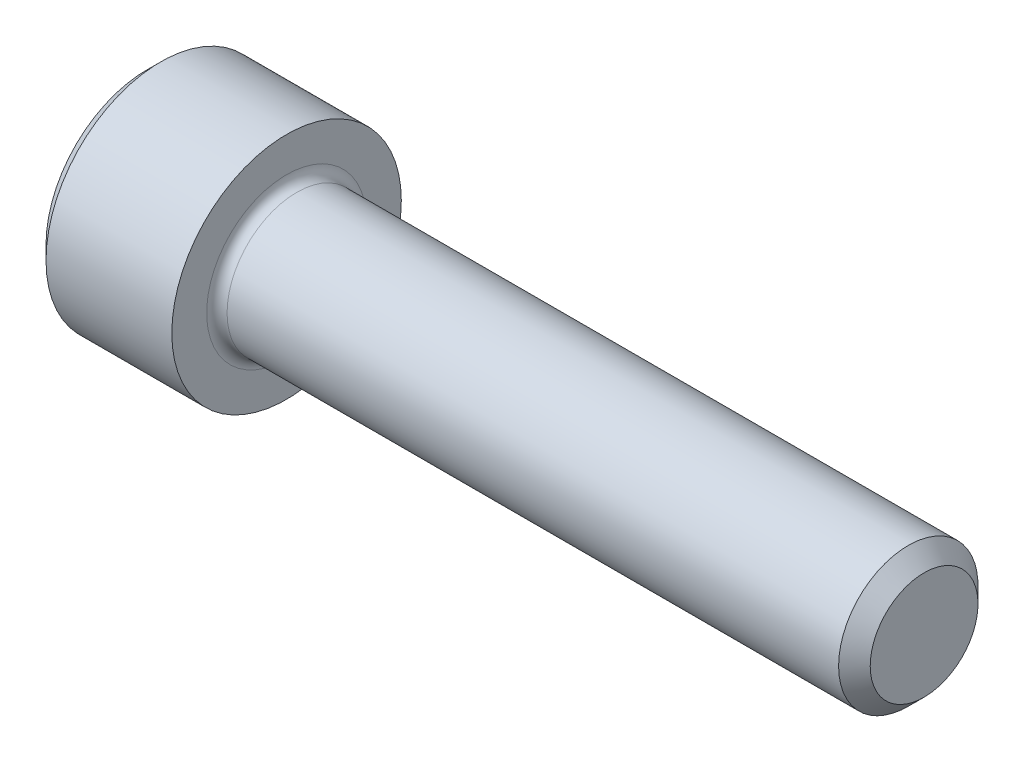
ISO-10303-21;
HEADER;
FILE_DESCRIPTION(('STEP AP214'),'2;1');
FILE_NAME('part.step','',(''),(''),'','','');
FILE_SCHEMA(('AUTOMOTIVE_DESIGN { 1 0 10303 214 1 1 1 1 }'));
ENDSEC;
DATA;
#1=APPLICATION_CONTEXT('core data for automotive mechanical design processes');
#2=APPLICATION_PROTOCOL_DEFINITION('international standard','automotive_design',2000,#1);
#3=PRODUCT_CONTEXT('',#1,'mechanical');
#4=PRODUCT('Part','Part','',(#3));
#5=PRODUCT_RELATED_PRODUCT_CATEGORY('part','',(#4));
#6=PRODUCT_DEFINITION_FORMATION('','',#4);
#7=PRODUCT_DEFINITION_CONTEXT('part definition',#1,'design');
#8=PRODUCT_DEFINITION('design','',#6,#7);
#9=PRODUCT_DEFINITION_SHAPE('','',#8);
#10=(LENGTH_UNIT() NAMED_UNIT(*) SI_UNIT(.MILLI.,.METRE.));
#11=(NAMED_UNIT(*) PLANE_ANGLE_UNIT() SI_UNIT($,.RADIAN.));
#12=(NAMED_UNIT(*) SI_UNIT($,.STERADIAN.) SOLID_ANGLE_UNIT());
#13=UNCERTAINTY_MEASURE_WITH_UNIT(LENGTH_MEASURE(1.E-05),#10,'distance_accuracy_value','');
#14=(GEOMETRIC_REPRESENTATION_CONTEXT(3) GLOBAL_UNCERTAINTY_ASSIGNED_CONTEXT((#13)) GLOBAL_UNIT_ASSIGNED_CONTEXT((#10,
#11,#12)) REPRESENTATION_CONTEXT('',''));
#15=CARTESIAN_POINT('',(0.,0.,0.));
#16=DIRECTION('',(0.,0.,1.));
#17=DIRECTION('',(1.,0.,0.));
#18=AXIS2_PLACEMENT_3D('',#15,#16,#17);
#19=CARTESIAN_POINT('',(0.,0.,0.));
#20=DIRECTION('',(-1.,0.,0.));
#21=DIRECTION('',(0.,0.,1.));
#22=AXIS2_PLACEMENT_3D('',#19,#20,#21);
#23=PLANE('',#22);
#24=CARTESIAN_POINT('',(0.,0.,0.));
#25=DIRECTION('',(-1.,0.,0.));
#26=DIRECTION('',(0.,0.,1.));
#27=AXIS2_PLACEMENT_3D('',#24,#25,#26);
#28=CIRCLE('',#27,3.02260000000001);
#29=CARTESIAN_POINT('',(0.,0.,3.02260000000001));
#30=VERTEX_POINT('',#29);
#31=EDGE_CURVE('E134',#30,#30,#28,.T.);
#32=ORIENTED_EDGE('',*,*,#31,.T.);
#33=EDGE_LOOP('',(#32));
#34=FACE_BOUND('',#33,.T.);
#35=DIRECTION('',(0.,-0.500000000000001,-0.866025403784438));
#36=VECTOR('',#35,1.);
#37=CARTESIAN_POINT('',(0.,2.05305755723831,0.));
#38=LINE('',#37,#36);
#39=CARTESIAN_POINT('',(0.,2.05305755723831,0.));
#40=VERTEX_POINT('',#39);
#41=CARTESIAN_POINT('',(0.,1.02652877861916,-1.778));
#42=VERTEX_POINT('',#41);
#43=EDGE_CURVE('E125',#40,#42,#38,.T.);
#44=ORIENTED_EDGE('',*,*,#43,.F.);
#45=DIRECTION('',(0.,-0.499999999999998,0.86602540378444));
#46=VECTOR('',#45,1.);
#47=CARTESIAN_POINT('',(0.,2.05305755723831,0.));
#48=LINE('',#47,#46);
#49=CARTESIAN_POINT('',(0.,1.02652877861916,1.778));
#50=VERTEX_POINT('',#49);
#51=EDGE_CURVE('E47',#40,#50,#48,.T.);
#52=ORIENTED_EDGE('',*,*,#51,.T.);
#53=DIRECTION('',(0.,1.,0.));
#54=VECTOR('',#53,1.);
#55=CARTESIAN_POINT('',(0.,-1.02652877861915,1.778));
#56=LINE('',#55,#54);
#57=CARTESIAN_POINT('',(0.,-1.02652877861915,1.778));
#58=VERTEX_POINT('',#57);
#59=EDGE_CURVE('E116',#58,#50,#56,.T.);
#60=ORIENTED_EDGE('',*,*,#59,.F.);
#61=DIRECTION('',(0.,-0.500000000000001,-0.866025403784438));
#62=VECTOR('',#61,1.);
#63=CARTESIAN_POINT('',(0.,-1.02652877861915,1.778));
#64=LINE('',#63,#62);
#65=CARTESIAN_POINT('',(0.,-2.0530575572383,0.));
#66=VERTEX_POINT('',#65);
#67=EDGE_CURVE('E119',#58,#66,#64,.T.);
#68=ORIENTED_EDGE('',*,*,#67,.T.);
#69=DIRECTION('',(0.,0.499999999999998,-0.86602540378444));
#70=VECTOR('',#69,1.);
#71=CARTESIAN_POINT('',(0.,-2.0530575572383,0.));
#72=LINE('',#71,#70);
#73=CARTESIAN_POINT('',(0.,-1.02652877861915,-1.778));
#74=VERTEX_POINT('',#73);
#75=EDGE_CURVE('E122',#66,#74,#72,.T.);
#76=ORIENTED_EDGE('',*,*,#75,.T.);
#77=DIRECTION('',(0.,-1.,0.));
#78=VECTOR('',#77,1.);
#79=CARTESIAN_POINT('',(0.,1.02652877861916,-1.778));
#80=LINE('',#79,#78);
#81=EDGE_CURVE('E105',#42,#74,#80,.T.);
#82=ORIENTED_EDGE('',*,*,#81,.F.);
#83=EDGE_LOOP('',(#44,#52,#60,#68,#76,#82));
#84=FACE_BOUND('',#83,.T.);
#85=ADVANCED_FACE('F32',(#34,#84),#23,.T.);
#86=CARTESIAN_POINT('',(23.2156,1.61036,0.));
#87=DIRECTION('',(1.,0.,0.));
#88=DIRECTION('',(0.,0.,-1.));
#89=AXIS2_PLACEMENT_3D('',#86,#87,#88);
#90=PLANE('',#89);
#91=CARTESIAN_POINT('',(23.2156,0.,0.));
#92=DIRECTION('',(-1.,0.,0.));
#93=DIRECTION('',(0.,0.,1.));
#94=AXIS2_PLACEMENT_3D('',#91,#92,#93);
#95=CIRCLE('',#94,1.61036);
#96=CARTESIAN_POINT('',(23.2156,0.,1.61036));
#97=VERTEX_POINT('',#96);
#98=EDGE_CURVE('E146',#97,#97,#95,.T.);
#99=ORIENTED_EDGE('',*,*,#98,.F.);
#100=EDGE_LOOP('',(#99));
#101=FACE_BOUND('',#100,.T.);
#102=ADVANCED_FACE('F169',(#101),#90,.T.);
#103=CARTESIAN_POINT('',(23.2156,0.,0.));
#104=DIRECTION('',(-1.,0.,0.));
#105=DIRECTION('',(0.,0.,1.));
#106=AXIS2_PLACEMENT_3D('',#103,#104,#105);
#107=CONICAL_SURFACE('',#106,1.61036,0.785398163397445);
#108=CARTESIAN_POINT('',(22.74316,0.,0.));
#109=DIRECTION('',(-1.,0.,0.));
#110=DIRECTION('',(0.,0.,1.));
#111=AXIS2_PLACEMENT_3D('',#108,#109,#110);
#112=CIRCLE('',#111,2.08279999999999);
#113=CARTESIAN_POINT('',(22.74316,0.,2.08279999999999));
#114=VERTEX_POINT('',#113);
#115=EDGE_CURVE('E143',#114,#114,#112,.T.);
#116=ORIENTED_EDGE('',*,*,#115,.F.);
#117=EDGE_LOOP('',(#116));
#118=FACE_BOUND('',#117,.T.);
#119=ORIENTED_EDGE('',*,*,#98,.T.);
#120=EDGE_LOOP('',(#119));
#121=FACE_BOUND('',#120,.T.);
#122=ADVANCED_FACE('F175',(#118,#121),#107,.T.);
#123=CARTESIAN_POINT('',(-31.75,0.,0.));
#124=DIRECTION('',(-1.,0.,0.));
#125=DIRECTION('',(0.,0.,1.));
#126=AXIS2_PLACEMENT_3D('',#123,#124,#125);
#127=CYLINDRICAL_SURFACE('',#126,2.0828);
#128=CARTESIAN_POINT('',(4.4704,0.,0.));
#129=DIRECTION('',(1.,0.,0.));
#130=DIRECTION('',(0.,0.,-1.));
#131=AXIS2_PLACEMENT_3D('',#128,#129,#130);
#132=CIRCLE('',#131,2.0828);
#133=CARTESIAN_POINT('',(4.4704,0.,-2.0828));
#134=VERTEX_POINT('',#133);
#135=EDGE_CURVE('E11',#134,#134,#132,.T.);
#136=ORIENTED_EDGE('',*,*,#135,.T.);
#137=EDGE_LOOP('',(#136));
#138=FACE_BOUND('',#137,.T.);
#139=ORIENTED_EDGE('',*,*,#115,.T.);
#140=EDGE_LOOP('',(#139));
#141=FACE_BOUND('',#140,.T.);
#142=ADVANCED_FACE('F185',(#138,#141),#127,.T.);
#143=CARTESIAN_POINT('',(4.1656,3.429,0.));
#144=DIRECTION('',(1.,0.,0.));
#145=DIRECTION('',(0.,0.,-1.));
#146=AXIS2_PLACEMENT_3D('',#143,#144,#145);
#147=PLANE('',#146);
#148=CARTESIAN_POINT('',(4.1656,0.,0.));
#149=DIRECTION('',(1.,0.,0.));
#150=DIRECTION('',(0.,0.,-1.));
#151=AXIS2_PLACEMENT_3D('',#148,#149,#150);
#152=CIRCLE('',#151,2.3876);
#153=CARTESIAN_POINT('',(4.1656,0.,-2.3876));
#154=VERTEX_POINT('',#153);
#155=EDGE_CURVE('E40',#154,#154,#152,.F.);
#156=ORIENTED_EDGE('',*,*,#155,.T.);
#157=EDGE_LOOP('',(#156));
#158=FACE_BOUND('',#157,.T.);
#159=CARTESIAN_POINT('',(4.16560000000001,0.,0.));
#160=DIRECTION('',(-1.,0.,0.));
#161=DIRECTION('',(0.,0.,1.));
#162=AXIS2_PLACEMENT_3D('',#159,#160,#161);
#163=CIRCLE('',#162,3.429);
#164=CARTESIAN_POINT('',(4.16560000000001,0.,3.429));
#165=VERTEX_POINT('',#164);
#166=EDGE_CURVE('E140',#165,#165,#163,.T.);
#167=ORIENTED_EDGE('',*,*,#166,.F.);
#168=EDGE_LOOP('',(#167));
#169=FACE_BOUND('',#168,.T.);
#170=ADVANCED_FACE('F151',(#158,#169),#147,.T.);
#171=CARTESIAN_POINT('',(-31.75,0.,0.));
#172=DIRECTION('',(-1.,0.,0.));
#173=DIRECTION('',(0.,0.,1.));
#174=AXIS2_PLACEMENT_3D('',#171,#172,#173);
#175=CYLINDRICAL_SURFACE('',#174,3.429);
#176=ORIENTED_EDGE('',*,*,#166,.T.);
#177=EDGE_LOOP('',(#176));
#178=FACE_BOUND('',#177,.T.);
#179=CARTESIAN_POINT('',(0.406400000000001,0.,0.));
#180=DIRECTION('',(-1.,0.,0.));
#181=DIRECTION('',(0.,0.,1.));
#182=AXIS2_PLACEMENT_3D('',#179,#180,#181);
#183=CIRCLE('',#182,3.429);
#184=CARTESIAN_POINT('',(0.406400000000001,0.,3.429));
#185=VERTEX_POINT('',#184);
#186=EDGE_CURVE('E137',#185,#185,#183,.T.);
#187=ORIENTED_EDGE('',*,*,#186,.F.);
#188=EDGE_LOOP('',(#187));
#189=FACE_BOUND('',#188,.T.);
#190=ADVANCED_FACE('F164',(#178,#189),#175,.T.);
#191=CARTESIAN_POINT('',(0.,0.,0.));
#192=DIRECTION('',(1.,0.,0.));
#193=DIRECTION('',(0.,0.,-1.));
#194=AXIS2_PLACEMENT_3D('',#191,#192,#193);
#195=CONICAL_SURFACE('',#194,3.02260000000001,0.785398163397438);
#196=ORIENTED_EDGE('',*,*,#186,.T.);
#197=EDGE_LOOP('',(#196));
#198=FACE_BOUND('',#197,.T.);
#199=ORIENTED_EDGE('',*,*,#31,.F.);
#200=EDGE_LOOP('',(#199));
#201=FACE_BOUND('',#200,.T.);
#202=ADVANCED_FACE('F156',(#198,#201),#195,.T.);
#203=CARTESIAN_POINT('',(4.4704,0.,0.));
#204=DIRECTION('',(1.,0.,0.));
#205=DIRECTION('',(0.,0.,-1.));
#206=AXIS2_PLACEMENT_3D('',#203,#204,#205);
#207=TOROIDAL_SURFACE('',#206,2.3876,0.3048);
#208=ORIENTED_EDGE('',*,*,#135,.F.);
#209=EDGE_LOOP('',(#208));
#210=FACE_BOUND('',#209,.T.);
#211=ORIENTED_EDGE('',*,*,#155,.F.);
#212=EDGE_LOOP('',(#211));
#213=FACE_BOUND('',#212,.T.);
#214=ADVANCED_FACE('F34',(#210,#213),#207,.F.);
#215=CARTESIAN_POINT('',(1.9558,2.05305755723831,0.));
#216=DIRECTION('',(0.,-0.86602540378444,-0.499999999999998));
#217=DIRECTION('',(0.,0.499999999999998,-0.86602540378444));
#218=AXIS2_PLACEMENT_3D('',#215,#216,#217);
#219=PLANE('',#218);
#220=ORIENTED_EDGE('',*,*,#51,.F.);
#221=DIRECTION('',(-1.,0.,0.));
#222=VECTOR('',#221,1.);
#223=CARTESIAN_POINT('',(1.9558,2.05305755723831,0.));
#224=LINE('',#223,#222);
#225=CARTESIAN_POINT('',(1.9558,2.05305755723831,0.));
#226=VERTEX_POINT('',#225);
#227=EDGE_CURVE('E52',#226,#40,#224,.T.);
#228=ORIENTED_EDGE('',*,*,#227,.F.);
#229=DIRECTION('',(0.,-0.499999999999998,0.86602540378444));
#230=VECTOR('',#229,1.);
#231=CARTESIAN_POINT('',(1.9558,2.05305755723831,0.));
#232=LINE('',#231,#230);
#233=CARTESIAN_POINT('',(1.9558,1.02652877861916,1.778));
#234=VERTEX_POINT('',#233);
#235=EDGE_CURVE('E79',#226,#234,#232,.T.);
#236=ORIENTED_EDGE('',*,*,#235,.T.);
#237=DIRECTION('',(-1.,0.,0.));
#238=VECTOR('',#237,1.);
#239=CARTESIAN_POINT('',(1.9558,1.02652877861916,1.778));
#240=LINE('',#239,#238);
#241=EDGE_CURVE('E132',#234,#50,#240,.T.);
#242=ORIENTED_EDGE('',*,*,#241,.T.);
#243=EDGE_LOOP('',(#220,#228,#236,#242));
#244=FACE_BOUND('',#243,.T.);
#245=ADVANCED_FACE('F155',(#244),#219,.T.);
#246=CARTESIAN_POINT('',(1.9558,-1.02652877861915,1.778));
#247=DIRECTION('',(0.,0.,1.));
#248=DIRECTION('',(0.,-1.,0.));
#249=AXIS2_PLACEMENT_3D('',#246,#247,#248);
#250=PLANE('',#249);
#251=ORIENTED_EDGE('',*,*,#59,.T.);
#252=ORIENTED_EDGE('',*,*,#241,.F.);
#253=DIRECTION('',(0.,1.,0.));
#254=VECTOR('',#253,1.);
#255=CARTESIAN_POINT('',(1.9558,-1.02652877861915,1.778));
#256=LINE('',#255,#254);
#257=CARTESIAN_POINT('',(1.9558,-1.02652877861915,1.778));
#258=VERTEX_POINT('',#257);
#259=EDGE_CURVE('E292',#258,#234,#256,.T.);
#260=ORIENTED_EDGE('',*,*,#259,.F.);
#261=DIRECTION('',(-1.,0.,0.));
#262=VECTOR('',#261,1.);
#263=CARTESIAN_POINT('',(1.9558,-1.02652877861915,1.778));
#264=LINE('',#263,#262);
#265=EDGE_CURVE('E130',#258,#58,#264,.T.);
#266=ORIENTED_EDGE('',*,*,#265,.T.);
#267=EDGE_LOOP('',(#251,#252,#260,#266));
#268=FACE_BOUND('',#267,.T.);
#269=ADVANCED_FACE('F162',(#268),#250,.F.);
#270=CARTESIAN_POINT('',(1.9558,-1.02652877861915,1.778));
#271=DIRECTION('',(0.,0.866025403784438,-0.500000000000001));
#272=DIRECTION('',(0.,0.500000000000001,0.866025403784438));
#273=AXIS2_PLACEMENT_3D('',#270,#271,#272);
#274=PLANE('',#273);
#275=ORIENTED_EDGE('',*,*,#67,.F.);
#276=ORIENTED_EDGE('',*,*,#265,.F.);
#277=DIRECTION('',(0.,-0.500000000000001,-0.866025403784438));
#278=VECTOR('',#277,1.);
#279=CARTESIAN_POINT('',(1.9558,-1.02652877861915,1.778));
#280=LINE('',#279,#278);
#281=CARTESIAN_POINT('',(1.9558,-2.0530575572383,0.));
#282=VERTEX_POINT('',#281);
#283=EDGE_CURVE('E100',#258,#282,#280,.T.);
#284=ORIENTED_EDGE('',*,*,#283,.T.);
#285=DIRECTION('',(-1.,0.,0.));
#286=VECTOR('',#285,1.);
#287=CARTESIAN_POINT('',(1.9558,-2.0530575572383,0.));
#288=LINE('',#287,#286);
#289=EDGE_CURVE('E95',#282,#66,#288,.T.);
#290=ORIENTED_EDGE('',*,*,#289,.T.);
#291=EDGE_LOOP('',(#275,#276,#284,#290));
#292=FACE_BOUND('',#291,.T.);
#293=ADVANCED_FACE('F240',(#292),#274,.T.);
#294=CARTESIAN_POINT('',(1.9558,-2.0530575572383,0.));
#295=DIRECTION('',(0.,0.86602540378444,0.499999999999998));
#296=DIRECTION('',(0.,-0.499999999999998,0.86602540378444));
#297=AXIS2_PLACEMENT_3D('',#294,#295,#296);
#298=PLANE('',#297);
#299=ORIENTED_EDGE('',*,*,#75,.F.);
#300=ORIENTED_EDGE('',*,*,#289,.F.);
#301=DIRECTION('',(0.,0.499999999999998,-0.86602540378444));
#302=VECTOR('',#301,1.);
#303=CARTESIAN_POINT('',(1.9558,-2.0530575572383,0.));
#304=LINE('',#303,#302);
#305=CARTESIAN_POINT('',(1.9558,-1.02652877861915,-1.778));
#306=VERTEX_POINT('',#305);
#307=EDGE_CURVE('E90',#282,#306,#304,.T.);
#308=ORIENTED_EDGE('',*,*,#307,.T.);
#309=DIRECTION('',(-1.,0.,0.));
#310=VECTOR('',#309,1.);
#311=CARTESIAN_POINT('',(1.9558,-1.02652877861915,-1.778));
#312=LINE('',#311,#310);
#313=EDGE_CURVE('E94',#306,#74,#312,.T.);
#314=ORIENTED_EDGE('',*,*,#313,.T.);
#315=EDGE_LOOP('',(#299,#300,#308,#314));
#316=FACE_BOUND('',#315,.T.);
#317=ADVANCED_FACE('F93',(#316),#298,.T.);
#318=CARTESIAN_POINT('',(1.9558,1.02652877861916,-1.778));
#319=DIRECTION('',(0.,0.,-1.));
#320=DIRECTION('',(0.,1.,0.));
#321=AXIS2_PLACEMENT_3D('',#318,#319,#320);
#322=PLANE('',#321);
#323=ORIENTED_EDGE('',*,*,#81,.T.);
#324=ORIENTED_EDGE('',*,*,#313,.F.);
#325=DIRECTION('',(0.,-1.,0.));
#326=VECTOR('',#325,1.);
#327=CARTESIAN_POINT('',(1.9558,1.02652877861916,-1.778));
#328=LINE('',#327,#326);
#329=CARTESIAN_POINT('',(1.9558,1.02652877861916,-1.778));
#330=VERTEX_POINT('',#329);
#331=EDGE_CURVE('E99',#330,#306,#328,.T.);
#332=ORIENTED_EDGE('',*,*,#331,.F.);
#333=DIRECTION('',(-1.,0.,0.));
#334=VECTOR('',#333,1.);
#335=CARTESIAN_POINT('',(1.9558,1.02652877861916,-1.778));
#336=LINE('',#335,#334);
#337=EDGE_CURVE('E75',#330,#42,#336,.T.);
#338=ORIENTED_EDGE('',*,*,#337,.T.);
#339=EDGE_LOOP('',(#323,#324,#332,#338));
#340=FACE_BOUND('',#339,.T.);
#341=ADVANCED_FACE('F102',(#340),#322,.F.);
#342=CARTESIAN_POINT('',(1.9558,2.05305755723831,0.));
#343=DIRECTION('',(0.,0.866025403784438,-0.500000000000001));
#344=DIRECTION('',(0.,0.500000000000001,0.866025403784438));
#345=AXIS2_PLACEMENT_3D('',#342,#343,#344);
#346=PLANE('',#345);
#347=ORIENTED_EDGE('',*,*,#43,.T.);
#348=ORIENTED_EDGE('',*,*,#337,.F.);
#349=DIRECTION('',(0.,-0.500000000000001,-0.866025403784438));
#350=VECTOR('',#349,1.);
#351=CARTESIAN_POINT('',(1.9558,2.05305755723831,0.));
#352=LINE('',#351,#350);
#353=EDGE_CURVE('E110',#226,#330,#352,.T.);
#354=ORIENTED_EDGE('',*,*,#353,.F.);
#355=ORIENTED_EDGE('',*,*,#227,.T.);
#356=EDGE_LOOP('',(#347,#348,#354,#355));
#357=FACE_BOUND('',#356,.T.);
#358=ADVANCED_FACE('F263',(#357),#346,.F.);
#359=CARTESIAN_POINT('',(1.9558,3.07958633585746,-1.778));
#360=DIRECTION('',(1.,0.,0.));
#361=DIRECTION('',(0.,0.,-1.));
#362=AXIS2_PLACEMENT_3D('',#359,#360,#361);
#363=PLANE('',#362);
#364=ORIENTED_EDGE('',*,*,#235,.F.);
#365=ORIENTED_EDGE('',*,*,#353,.T.);
#366=ORIENTED_EDGE('',*,*,#331,.T.);
#367=ORIENTED_EDGE('',*,*,#307,.F.);
#368=ORIENTED_EDGE('',*,*,#283,.F.);
#369=ORIENTED_EDGE('',*,*,#259,.T.);
#370=EDGE_LOOP('',(#364,#365,#366,#367,#368,#369));
#371=FACE_BOUND('',#370,.T.);
#372=ADVANCED_FACE('F108',(#371),#363,.F.);
#373=CLOSED_SHELL('',(#85,#102,#122,#142,#170,#190,#202,#214,#245,#269,#293,#317,#341,#358,#372));
#374=MANIFOLD_SOLID_BREP('B2',#373);
#375=ADVANCED_BREP_SHAPE_REPRESENTATION('',(#18,#374),#14);
#376=SHAPE_DEFINITION_REPRESENTATION(#9,#375);
ENDSEC;
END-ISO-10303-21;
